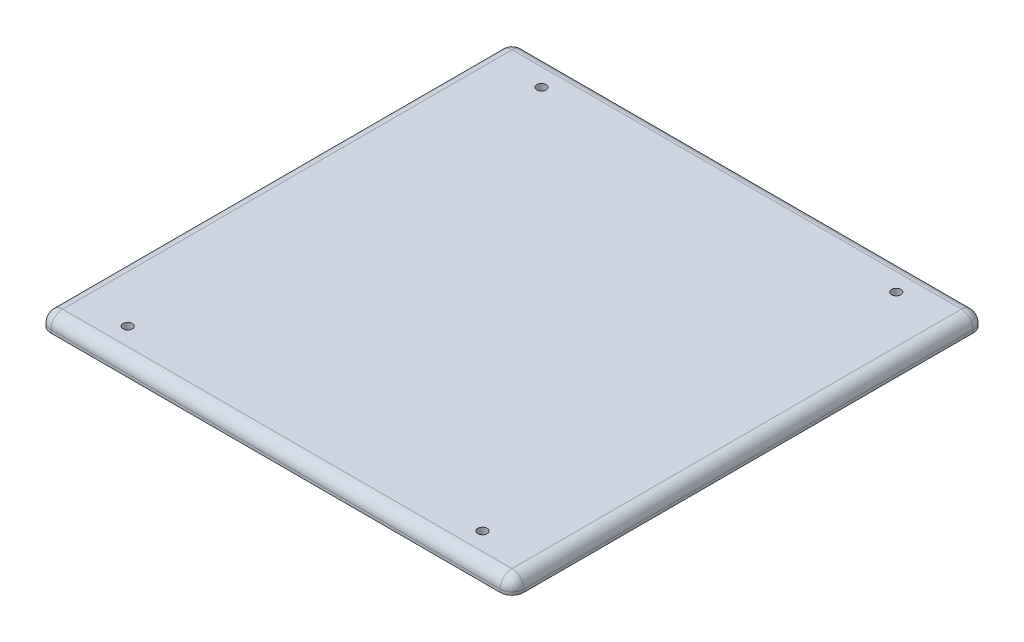
ISO-10303-21;
HEADER;
FILE_DESCRIPTION(('STEP AP214'),'2;1');
FILE_NAME('part.step','',(''),(''),'','','');
FILE_SCHEMA(('AUTOMOTIVE_DESIGN { 1 0 10303 214 1 1 1 1 }'));
ENDSEC;
DATA;
#1=APPLICATION_CONTEXT('core data for automotive mechanical design processes');
#2=APPLICATION_PROTOCOL_DEFINITION('international standard','automotive_design',2000,#1);
#3=PRODUCT_CONTEXT('',#1,'mechanical');
#4=PRODUCT('Part','Part','',(#3));
#5=PRODUCT_RELATED_PRODUCT_CATEGORY('part','',(#4));
#6=PRODUCT_DEFINITION_FORMATION('','',#4);
#7=PRODUCT_DEFINITION_CONTEXT('part definition',#1,'design');
#8=PRODUCT_DEFINITION('design','',#6,#7);
#9=PRODUCT_DEFINITION_SHAPE('','',#8);
#10=(LENGTH_UNIT() NAMED_UNIT(*) SI_UNIT(.MILLI.,.METRE.));
#11=(NAMED_UNIT(*) PLANE_ANGLE_UNIT() SI_UNIT($,.RADIAN.));
#12=(NAMED_UNIT(*) SI_UNIT($,.STERADIAN.) SOLID_ANGLE_UNIT());
#13=UNCERTAINTY_MEASURE_WITH_UNIT(LENGTH_MEASURE(1.E-05),#10,'distance_accuracy_value','');
#14=(GEOMETRIC_REPRESENTATION_CONTEXT(3) GLOBAL_UNCERTAINTY_ASSIGNED_CONTEXT((#13)) GLOBAL_UNIT_ASSIGNED_CONTEXT((#10,
#11,#12)) REPRESENTATION_CONTEXT('',''));
#15=CARTESIAN_POINT('',(0.,0.,0.));
#16=DIRECTION('',(0.,0.,1.));
#17=DIRECTION('',(1.,0.,0.));
#18=AXIS2_PLACEMENT_3D('',#15,#16,#17);
#19=CARTESIAN_POINT('',(-50.8,3.175,50.8));
#20=DIRECTION('',(1.,0.,0.));
#21=DIRECTION('',(0.,0.,-1.));
#22=AXIS2_PLACEMENT_3D('',#19,#20,#21);
#23=PLANE('',#22);
#24=DIRECTION('',(0.,0.,1.));
#25=VECTOR('',#24,1.);
#26=CARTESIAN_POINT('',(-50.8,0.,50.8));
#27=LINE('',#26,#25);
#28=CARTESIAN_POINT('',(-50.8,0.,-48.26));
#29=VERTEX_POINT('',#28);
#30=CARTESIAN_POINT('',(-50.8,0.,48.26));
#31=VERTEX_POINT('',#30);
#32=EDGE_CURVE('E158',#29,#31,#27,.T.);
#33=ORIENTED_EDGE('',*,*,#32,.T.);
#34=DIRECTION('',(0.,-1.,0.));
#35=VECTOR('',#34,1.);
#36=CARTESIAN_POINT('',(-50.8,3.175,48.26));
#37=LINE('',#36,#35);
#38=CARTESIAN_POINT('',(-50.8,0.635,48.26));
#39=VERTEX_POINT('',#38);
#40=EDGE_CURVE('E133',#31,#39,#37,.F.);
#41=ORIENTED_EDGE('',*,*,#40,.T.);
#42=DIRECTION('',(0.,0.,1.));
#43=VECTOR('',#42,1.);
#44=CARTESIAN_POINT('',(-50.8,0.635,-50.8));
#45=LINE('',#44,#43);
#46=CARTESIAN_POINT('',(-50.8,0.635,-48.26));
#47=VERTEX_POINT('',#46);
#48=EDGE_CURVE('E139',#39,#47,#45,.F.);
#49=ORIENTED_EDGE('',*,*,#48,.T.);
#50=DIRECTION('',(0.,-1.,0.));
#51=VECTOR('',#50,1.);
#52=CARTESIAN_POINT('',(-50.8,3.175,-48.26));
#53=LINE('',#52,#51);
#54=EDGE_CURVE('E217',#47,#29,#53,.T.);
#55=ORIENTED_EDGE('',*,*,#54,.T.);
#56=EDGE_LOOP('',(#33,#41,#49,#55));
#57=FACE_BOUND('',#56,.T.);
#58=ADVANCED_FACE('F47',(#57),#23,.F.);
#59=CARTESIAN_POINT('',(50.8,3.175,50.8));
#60=DIRECTION('',(0.,0.,-1.));
#61=DIRECTION('',(-1.,0.,0.));
#62=AXIS2_PLACEMENT_3D('',#59,#60,#61);
#63=PLANE('',#62);
#64=DIRECTION('',(1.,0.,0.));
#65=VECTOR('',#64,1.);
#66=CARTESIAN_POINT('',(-50.8,0.635,50.8));
#67=LINE('',#66,#65);
#68=CARTESIAN_POINT('',(48.26,0.635,50.8));
#69=VERTEX_POINT('',#68);
#70=CARTESIAN_POINT('',(-48.26,0.635,50.8));
#71=VERTEX_POINT('',#70);
#72=EDGE_CURVE('E147',#69,#71,#67,.F.);
#73=ORIENTED_EDGE('',*,*,#72,.T.);
#74=DIRECTION('',(0.,-1.,0.));
#75=VECTOR('',#74,1.);
#76=CARTESIAN_POINT('',(-48.26,3.175,50.8));
#77=LINE('',#76,#75);
#78=CARTESIAN_POINT('',(-48.26,0.,50.8));
#79=VERTEX_POINT('',#78);
#80=EDGE_CURVE('E132',#71,#79,#77,.T.);
#81=ORIENTED_EDGE('',*,*,#80,.T.);
#82=DIRECTION('',(1.,0.,0.));
#83=VECTOR('',#82,1.);
#84=CARTESIAN_POINT('',(50.8,0.,50.8));
#85=LINE('',#84,#83);
#86=CARTESIAN_POINT('',(48.26,0.,50.8));
#87=VERTEX_POINT('',#86);
#88=EDGE_CURVE('E145',#79,#87,#85,.T.);
#89=ORIENTED_EDGE('',*,*,#88,.T.);
#90=DIRECTION('',(0.,-1.,0.));
#91=VECTOR('',#90,1.);
#92=CARTESIAN_POINT('',(48.26,3.175,50.8));
#93=LINE('',#92,#91);
#94=EDGE_CURVE('E151',#87,#69,#93,.F.);
#95=ORIENTED_EDGE('',*,*,#94,.T.);
#96=EDGE_LOOP('',(#73,#81,#89,#95));
#97=FACE_BOUND('',#96,.T.);
#98=ADVANCED_FACE('F144',(#97),#63,.F.);
#99=CARTESIAN_POINT('',(50.8,3.175,50.8));
#100=DIRECTION('',(-1.,0.,0.));
#101=DIRECTION('',(0.,0.,1.));
#102=AXIS2_PLACEMENT_3D('',#99,#100,#101);
#103=PLANE('',#102);
#104=DIRECTION('',(0.,0.,-1.));
#105=VECTOR('',#104,1.);
#106=CARTESIAN_POINT('',(50.8,0.,50.8));
#107=LINE('',#106,#105);
#108=CARTESIAN_POINT('',(50.8,0.,48.26));
#109=VERTEX_POINT('',#108);
#110=CARTESIAN_POINT('',(50.8,0.,-48.26));
#111=VERTEX_POINT('',#110);
#112=EDGE_CURVE('E157',#109,#111,#107,.T.);
#113=ORIENTED_EDGE('',*,*,#112,.T.);
#114=DIRECTION('',(0.,-1.,0.));
#115=VECTOR('',#114,1.);
#116=CARTESIAN_POINT('',(50.8,3.175,-48.26));
#117=LINE('',#116,#115);
#118=CARTESIAN_POINT('',(50.8,0.635,-48.26));
#119=VERTEX_POINT('',#118);
#120=EDGE_CURVE('E237',#111,#119,#117,.F.);
#121=ORIENTED_EDGE('',*,*,#120,.T.);
#122=DIRECTION('',(0.,0.,-1.));
#123=VECTOR('',#122,1.);
#124=CARTESIAN_POINT('',(50.8,0.635,50.8));
#125=LINE('',#124,#123);
#126=CARTESIAN_POINT('',(50.8,0.635,48.26));
#127=VERTEX_POINT('',#126);
#128=EDGE_CURVE('E231',#119,#127,#125,.F.);
#129=ORIENTED_EDGE('',*,*,#128,.T.);
#130=DIRECTION('',(0.,-1.,0.));
#131=VECTOR('',#130,1.);
#132=CARTESIAN_POINT('',(50.8,3.175,48.26));
#133=LINE('',#132,#131);
#134=EDGE_CURVE('E234',#127,#109,#133,.T.);
#135=ORIENTED_EDGE('',*,*,#134,.T.);
#136=EDGE_LOOP('',(#113,#121,#129,#135));
#137=FACE_BOUND('',#136,.T.);
#138=ADVANCED_FACE('F328',(#137),#103,.F.);
#139=CARTESIAN_POINT('',(50.8,3.175,-50.8));
#140=DIRECTION('',(0.,0.,1.));
#141=DIRECTION('',(1.,0.,0.));
#142=AXIS2_PLACEMENT_3D('',#139,#140,#141);
#143=PLANE('',#142);
#144=DIRECTION('',(-1.,0.,0.));
#145=VECTOR('',#144,1.);
#146=CARTESIAN_POINT('',(50.8,0.,-50.8));
#147=LINE('',#146,#145);
#148=CARTESIAN_POINT('',(48.26,0.,-50.8));
#149=VERTEX_POINT('',#148);
#150=CARTESIAN_POINT('',(-48.26,0.,-50.8));
#151=VERTEX_POINT('',#150);
#152=EDGE_CURVE('E163',#149,#151,#147,.T.);
#153=ORIENTED_EDGE('',*,*,#152,.T.);
#154=DIRECTION('',(0.,-1.,0.));
#155=VECTOR('',#154,1.);
#156=CARTESIAN_POINT('',(-48.26,3.175,-50.8));
#157=LINE('',#156,#155);
#158=CARTESIAN_POINT('',(-48.26,0.635,-50.8));
#159=VERTEX_POINT('',#158);
#160=EDGE_CURVE('E228',#151,#159,#157,.F.);
#161=ORIENTED_EDGE('',*,*,#160,.T.);
#162=DIRECTION('',(-1.,0.,0.));
#163=VECTOR('',#162,1.);
#164=CARTESIAN_POINT('',(50.8,0.635,-50.8));
#165=LINE('',#164,#163);
#166=CARTESIAN_POINT('',(48.26,0.635,-50.8));
#167=VERTEX_POINT('',#166);
#168=EDGE_CURVE('E222',#159,#167,#165,.F.);
#169=ORIENTED_EDGE('',*,*,#168,.T.);
#170=DIRECTION('',(0.,-1.,0.));
#171=VECTOR('',#170,1.);
#172=CARTESIAN_POINT('',(48.26,3.175,-50.8));
#173=LINE('',#172,#171);
#174=EDGE_CURVE('E225',#167,#149,#173,.T.);
#175=ORIENTED_EDGE('',*,*,#174,.T.);
#176=EDGE_LOOP('',(#153,#161,#169,#175));
#177=FACE_BOUND('',#176,.T.);
#178=ADVANCED_FACE('F319',(#177),#143,.F.);
#179=CARTESIAN_POINT('',(0.,3.175,0.));
#180=DIRECTION('',(0.,1.,0.));
#181=DIRECTION('',(0.,0.,1.));
#182=AXIS2_PLACEMENT_3D('',#179,#180,#181);
#183=PLANE('',#182);
#184=DIRECTION('',(0.,0.,1.));
#185=VECTOR('',#184,1.);
#186=CARTESIAN_POINT('',(-48.26,3.175,50.8));
#187=LINE('',#186,#185);
#188=CARTESIAN_POINT('',(-48.26,3.175,-48.26));
#189=VERTEX_POINT('',#188);
#190=CARTESIAN_POINT('',(-48.26,3.175,48.26));
#191=VERTEX_POINT('',#190);
#192=EDGE_CURVE('E240',#189,#191,#187,.T.);
#193=ORIENTED_EDGE('',*,*,#192,.T.);
#194=DIRECTION('',(1.,0.,0.));
#195=VECTOR('',#194,1.);
#196=CARTESIAN_POINT('',(50.8,3.175,48.26));
#197=LINE('',#196,#195);
#198=CARTESIAN_POINT('',(48.26,3.175,48.26));
#199=VERTEX_POINT('',#198);
#200=EDGE_CURVE('E11',#191,#199,#197,.T.);
#201=ORIENTED_EDGE('',*,*,#200,.T.);
#202=DIRECTION('',(0.,0.,-1.));
#203=VECTOR('',#202,1.);
#204=CARTESIAN_POINT('',(48.26,3.175,-50.8));
#205=LINE('',#204,#203);
#206=CARTESIAN_POINT('',(48.26,3.175,-48.26));
#207=VERTEX_POINT('',#206);
#208=EDGE_CURVE('E57',#199,#207,#205,.T.);
#209=ORIENTED_EDGE('',*,*,#208,.T.);
#210=DIRECTION('',(-1.,0.,0.));
#211=VECTOR('',#210,1.);
#212=CARTESIAN_POINT('',(-50.8,3.175,-48.26));
#213=LINE('',#212,#211);
#214=EDGE_CURVE('E243',#207,#189,#213,.T.);
#215=ORIENTED_EDGE('',*,*,#214,.T.);
#216=EDGE_LOOP('',(#193,#201,#209,#215));
#217=FACE_BOUND('',#216,.T.);
#218=CARTESIAN_POINT('',(-38.1,3.175,-44.45));
#219=DIRECTION('',(0.,1.,0.));
#220=DIRECTION('',(0.,0.,-1.));
#221=AXIS2_PLACEMENT_3D('',#218,#219,#220);
#222=CIRCLE('',#221,0.999490000000001);
#223=CARTESIAN_POINT('',(-38.1,3.175,-45.44949));
#224=VERTEX_POINT('',#223);
#225=EDGE_CURVE('E291',#224,#224,#222,.T.);
#226=ORIENTED_EDGE('',*,*,#225,.F.);
#227=EDGE_LOOP('',(#226));
#228=FACE_BOUND('',#227,.T.);
#229=CARTESIAN_POINT('',(38.1,3.175,-44.45));
#230=DIRECTION('',(0.,1.,0.));
#231=DIRECTION('',(0.,0.,1.));
#232=AXIS2_PLACEMENT_3D('',#229,#230,#231);
#233=CIRCLE('',#232,0.999490000000001);
#234=CARTESIAN_POINT('',(38.1,3.175,-43.45051));
#235=VERTEX_POINT('',#234);
#236=EDGE_CURVE('E297',#235,#235,#233,.T.);
#237=ORIENTED_EDGE('',*,*,#236,.F.);
#238=EDGE_LOOP('',(#237));
#239=FACE_BOUND('',#238,.T.);
#240=CARTESIAN_POINT('',(38.1,3.175,44.45));
#241=DIRECTION('',(0.,1.,0.));
#242=DIRECTION('',(0.,0.,-1.));
#243=AXIS2_PLACEMENT_3D('',#240,#241,#242);
#244=CIRCLE('',#243,0.999490000000001);
#245=CARTESIAN_POINT('',(38.1,3.175,43.45051));
#246=VERTEX_POINT('',#245);
#247=EDGE_CURVE('E303',#246,#246,#244,.T.);
#248=ORIENTED_EDGE('',*,*,#247,.F.);
#249=EDGE_LOOP('',(#248));
#250=FACE_BOUND('',#249,.T.);
#251=CARTESIAN_POINT('',(-38.1,3.175,44.45));
#252=DIRECTION('',(0.,1.,0.));
#253=DIRECTION('',(0.,0.,1.));
#254=AXIS2_PLACEMENT_3D('',#251,#252,#253);
#255=CIRCLE('',#254,0.999490000000001);
#256=CARTESIAN_POINT('',(-38.1,3.175,45.44949));
#257=VERTEX_POINT('',#256);
#258=EDGE_CURVE('E165',#257,#257,#255,.T.);
#259=ORIENTED_EDGE('',*,*,#258,.F.);
#260=EDGE_LOOP('',(#259));
#261=FACE_BOUND('',#260,.T.);
#262=ADVANCED_FACE('F316',(#217,#228,#239,#250,#261),#183,.T.);
#263=CARTESIAN_POINT('',(0.,0.,0.));
#264=DIRECTION('',(0.,1.,0.));
#265=DIRECTION('',(0.,0.,1.));
#266=AXIS2_PLACEMENT_3D('',#263,#264,#265);
#267=PLANE('',#266);
#268=CARTESIAN_POINT('',(-38.1,0.,44.45));
#269=DIRECTION('',(0.,1.,0.));
#270=DIRECTION('',(0.,0.,1.));
#271=AXIS2_PLACEMENT_3D('',#268,#269,#270);
#272=CIRCLE('',#271,2.26949000000001);
#273=CARTESIAN_POINT('',(-38.1,0.,46.71949));
#274=VERTEX_POINT('',#273);
#275=EDGE_CURVE('E184',#274,#274,#272,.T.);
#276=ORIENTED_EDGE('',*,*,#275,.T.);
#277=EDGE_LOOP('',(#276));
#278=FACE_BOUND('',#277,.T.);
#279=CARTESIAN_POINT('',(38.1,0.,44.45));
#280=DIRECTION('',(0.,1.,0.));
#281=DIRECTION('',(0.,0.,1.));
#282=AXIS2_PLACEMENT_3D('',#279,#280,#281);
#283=CIRCLE('',#282,2.26948999999997);
#284=CARTESIAN_POINT('',(38.1,0.,46.7194899999999));
#285=VERTEX_POINT('',#284);
#286=EDGE_CURVE('E180',#285,#285,#283,.T.);
#287=ORIENTED_EDGE('',*,*,#286,.T.);
#288=EDGE_LOOP('',(#287));
#289=FACE_BOUND('',#288,.T.);
#290=CARTESIAN_POINT('',(-38.1,0.,-44.45));
#291=DIRECTION('',(0.,1.,0.));
#292=DIRECTION('',(0.,0.,1.));
#293=AXIS2_PLACEMENT_3D('',#290,#291,#292);
#294=CIRCLE('',#293,2.26949000000001);
#295=CARTESIAN_POINT('',(-38.1,0.,-42.18051));
#296=VERTEX_POINT('',#295);
#297=EDGE_CURVE('E176',#296,#296,#294,.T.);
#298=ORIENTED_EDGE('',*,*,#297,.T.);
#299=EDGE_LOOP('',(#298));
#300=FACE_BOUND('',#299,.T.);
#301=CARTESIAN_POINT('',(38.1,0.,-44.45));
#302=DIRECTION('',(0.,1.,0.));
#303=DIRECTION('',(0.,0.,1.));
#304=AXIS2_PLACEMENT_3D('',#301,#302,#303);
#305=CIRCLE('',#304,2.26948999999997);
#306=CARTESIAN_POINT('',(38.1,0.,-42.18051));
#307=VERTEX_POINT('',#306);
#308=EDGE_CURVE('E172',#307,#307,#305,.T.);
#309=ORIENTED_EDGE('',*,*,#308,.T.);
#310=EDGE_LOOP('',(#309));
#311=FACE_BOUND('',#310,.T.);
#312=ORIENTED_EDGE('',*,*,#88,.F.);
#313=CARTESIAN_POINT('',(-48.26,0.,48.26));
#314=DIRECTION('',(0.,1.,0.));
#315=DIRECTION('',(0.,0.,1.));
#316=AXIS2_PLACEMENT_3D('',#313,#314,#315);
#317=CIRCLE('',#316,2.54);
#318=EDGE_CURVE('E128',#79,#31,#317,.F.);
#319=ORIENTED_EDGE('',*,*,#318,.T.);
#320=ORIENTED_EDGE('',*,*,#32,.F.);
#321=CARTESIAN_POINT('',(-48.26,0.,-48.26));
#322=DIRECTION('',(0.,1.,0.));
#323=DIRECTION('',(0.,0.,1.));
#324=AXIS2_PLACEMENT_3D('',#321,#322,#323);
#325=CIRCLE('',#324,2.54);
#326=EDGE_CURVE('E140',#29,#151,#325,.F.);
#327=ORIENTED_EDGE('',*,*,#326,.T.);
#328=ORIENTED_EDGE('',*,*,#152,.F.);
#329=CARTESIAN_POINT('',(48.26,0.,-48.26));
#330=DIRECTION('',(0.,1.,0.));
#331=DIRECTION('',(0.,0.,1.));
#332=AXIS2_PLACEMENT_3D('',#329,#330,#331);
#333=CIRCLE('',#332,2.54);
#334=EDGE_CURVE('E210',#149,#111,#333,.F.);
#335=ORIENTED_EDGE('',*,*,#334,.T.);
#336=ORIENTED_EDGE('',*,*,#112,.F.);
#337=CARTESIAN_POINT('',(48.26,0.,48.26));
#338=DIRECTION('',(0.,1.,0.));
#339=DIRECTION('',(0.,0.,1.));
#340=AXIS2_PLACEMENT_3D('',#337,#338,#339);
#341=CIRCLE('',#340,2.54);
#342=EDGE_CURVE('E150',#109,#87,#341,.F.);
#343=ORIENTED_EDGE('',*,*,#342,.T.);
#344=EDGE_LOOP('',(#312,#319,#320,#327,#328,#335,#336,#343));
#345=FACE_BOUND('',#344,.T.);
#346=ADVANCED_FACE('F153',(#278,#289,#300,#311,#345),#267,.F.);
#347=CARTESIAN_POINT('',(-38.1,0.,44.45));
#348=DIRECTION('',(0.,1.,0.));
#349=DIRECTION('',(0.,0.,1.));
#350=AXIS2_PLACEMENT_3D('',#347,#348,#349);
#351=CYLINDRICAL_SURFACE('',#350,0.999490000000001);
#352=CARTESIAN_POINT('',(-38.1,1.27000000000002,44.45));
#353=DIRECTION('',(0.,1.,0.));
#354=DIRECTION('',(0.,0.,1.));
#355=AXIS2_PLACEMENT_3D('',#352,#353,#354);
#356=CIRCLE('',#355,0.999490000000001);
#357=CARTESIAN_POINT('',(-38.1,1.27000000000002,45.44949));
#358=VERTEX_POINT('',#357);
#359=EDGE_CURVE('E188',#358,#358,#356,.F.);
#360=ORIENTED_EDGE('',*,*,#359,.T.);
#361=EDGE_LOOP('',(#360));
#362=FACE_BOUND('',#361,.T.);
#363=ORIENTED_EDGE('',*,*,#258,.T.);
#364=EDGE_LOOP('',(#363));
#365=FACE_BOUND('',#364,.T.);
#366=ADVANCED_FACE('F325',(#362,#365),#351,.F.);
#367=CARTESIAN_POINT('',(38.1,0.,44.45));
#368=DIRECTION('',(0.,1.,0.));
#369=DIRECTION('',(0.,0.,1.));
#370=AXIS2_PLACEMENT_3D('',#367,#368,#369);
#371=CYLINDRICAL_SURFACE('',#370,0.999490000000001);
#372=CARTESIAN_POINT('',(38.1,1.26999999999998,44.45));
#373=DIRECTION('',(0.,1.,0.));
#374=DIRECTION('',(0.,0.,1.));
#375=AXIS2_PLACEMENT_3D('',#372,#373,#374);
#376=CIRCLE('',#375,0.999490000000001);
#377=CARTESIAN_POINT('',(38.1,1.26999999999998,45.44949));
#378=VERTEX_POINT('',#377);
#379=EDGE_CURVE('E192',#378,#378,#376,.F.);
#380=ORIENTED_EDGE('',*,*,#379,.T.);
#381=EDGE_LOOP('',(#380));
#382=FACE_BOUND('',#381,.T.);
#383=ORIENTED_EDGE('',*,*,#247,.T.);
#384=EDGE_LOOP('',(#383));
#385=FACE_BOUND('',#384,.T.);
#386=ADVANCED_FACE('F314',(#382,#385),#371,.F.);
#387=CARTESIAN_POINT('',(38.1,0.,-44.45));
#388=DIRECTION('',(0.,1.,0.));
#389=DIRECTION('',(0.,0.,1.));
#390=AXIS2_PLACEMENT_3D('',#387,#388,#389);
#391=CYLINDRICAL_SURFACE('',#390,0.999490000000001);
#392=CARTESIAN_POINT('',(38.1,1.26999999999998,-44.45));
#393=DIRECTION('',(0.,1.,0.));
#394=DIRECTION('',(0.,0.,1.));
#395=AXIS2_PLACEMENT_3D('',#392,#393,#394);
#396=CIRCLE('',#395,0.999490000000001);
#397=CARTESIAN_POINT('',(38.1,1.26999999999998,-43.45051));
#398=VERTEX_POINT('',#397);
#399=EDGE_CURVE('E200',#398,#398,#396,.F.);
#400=ORIENTED_EDGE('',*,*,#399,.T.);
#401=EDGE_LOOP('',(#400));
#402=FACE_BOUND('',#401,.T.);
#403=ORIENTED_EDGE('',*,*,#236,.T.);
#404=EDGE_LOOP('',(#403));
#405=FACE_BOUND('',#404,.T.);
#406=ADVANCED_FACE('F469',(#402,#405),#391,.F.);
#407=CARTESIAN_POINT('',(-38.1,0.,-44.45));
#408=DIRECTION('',(0.,1.,0.));
#409=DIRECTION('',(0.,0.,1.));
#410=AXIS2_PLACEMENT_3D('',#407,#408,#409);
#411=CYLINDRICAL_SURFACE('',#410,0.999490000000001);
#412=CARTESIAN_POINT('',(-38.1,1.27000000000002,-44.45));
#413=DIRECTION('',(0.,1.,0.));
#414=DIRECTION('',(0.,0.,1.));
#415=AXIS2_PLACEMENT_3D('',#412,#413,#414);
#416=CIRCLE('',#415,0.999490000000001);
#417=CARTESIAN_POINT('',(-38.1,1.27000000000002,-43.45051));
#418=VERTEX_POINT('',#417);
#419=EDGE_CURVE('E196',#418,#418,#416,.F.);
#420=ORIENTED_EDGE('',*,*,#419,.T.);
#421=EDGE_LOOP('',(#420));
#422=FACE_BOUND('',#421,.T.);
#423=ORIENTED_EDGE('',*,*,#225,.T.);
#424=EDGE_LOOP('',(#423));
#425=FACE_BOUND('',#424,.T.);
#426=ADVANCED_FACE('F351',(#422,#425),#411,.F.);
#427=CARTESIAN_POINT('',(-38.1,0.,44.45));
#428=DIRECTION('',(0.,-1.,0.));
#429=DIRECTION('',(0.,0.,-1.));
#430=AXIS2_PLACEMENT_3D('',#427,#428,#429);
#431=CONICAL_SURFACE('',#430,2.26949000000001,0.785398163397446);
#432=ORIENTED_EDGE('',*,*,#359,.F.);
#433=EDGE_LOOP('',(#432));
#434=FACE_BOUND('',#433,.T.);
#435=ORIENTED_EDGE('',*,*,#275,.F.);
#436=EDGE_LOOP('',(#435));
#437=FACE_BOUND('',#436,.T.);
#438=ADVANCED_FACE('F344',(#434,#437),#431,.F.);
#439=CARTESIAN_POINT('',(38.1,0.,44.45));
#440=DIRECTION('',(0.,-1.,0.));
#441=DIRECTION('',(0.,0.,-1.));
#442=AXIS2_PLACEMENT_3D('',#439,#440,#441);
#443=CONICAL_SURFACE('',#442,2.26948999999997,0.785398163397446);
#444=ORIENTED_EDGE('',*,*,#379,.F.);
#445=EDGE_LOOP('',(#444));
#446=FACE_BOUND('',#445,.T.);
#447=ORIENTED_EDGE('',*,*,#286,.F.);
#448=EDGE_LOOP('',(#447));
#449=FACE_BOUND('',#448,.T.);
#450=ADVANCED_FACE('F350',(#446,#449),#443,.F.);
#451=CARTESIAN_POINT('',(-38.1,0.,-44.45));
#452=DIRECTION('',(0.,-1.,0.));
#453=DIRECTION('',(0.,0.,-1.));
#454=AXIS2_PLACEMENT_3D('',#451,#452,#453);
#455=CONICAL_SURFACE('',#454,2.26949000000001,0.785398163397446);
#456=ORIENTED_EDGE('',*,*,#419,.F.);
#457=EDGE_LOOP('',(#456));
#458=FACE_BOUND('',#457,.T.);
#459=ORIENTED_EDGE('',*,*,#297,.F.);
#460=EDGE_LOOP('',(#459));
#461=FACE_BOUND('',#460,.T.);
#462=ADVANCED_FACE('F358',(#458,#461),#455,.F.);
#463=CARTESIAN_POINT('',(38.1,0.,-44.45));
#464=DIRECTION('',(0.,-1.,0.));
#465=DIRECTION('',(0.,0.,-1.));
#466=AXIS2_PLACEMENT_3D('',#463,#464,#465);
#467=CONICAL_SURFACE('',#466,2.26948999999997,0.785398163397446);
#468=ORIENTED_EDGE('',*,*,#399,.F.);
#469=EDGE_LOOP('',(#468));
#470=FACE_BOUND('',#469,.T.);
#471=ORIENTED_EDGE('',*,*,#308,.F.);
#472=EDGE_LOOP('',(#471));
#473=FACE_BOUND('',#472,.T.);
#474=ADVANCED_FACE('F365',(#470,#473),#467,.F.);
#475=CARTESIAN_POINT('',(48.26,3.175,-48.26));
#476=DIRECTION('',(0.,-1.,0.));
#477=DIRECTION('',(0.,0.,-1.));
#478=AXIS2_PLACEMENT_3D('',#475,#476,#477);
#479=CYLINDRICAL_SURFACE('',#478,2.54);
#480=CARTESIAN_POINT('',(48.26,0.635,-48.26));
#481=DIRECTION('',(0.,1.,0.));
#482=DIRECTION('',(0.,0.,1.));
#483=AXIS2_PLACEMENT_3D('',#480,#481,#482);
#484=CIRCLE('',#483,2.54);
#485=EDGE_CURVE('E51',#119,#167,#484,.T.);
#486=ORIENTED_EDGE('',*,*,#485,.F.);
#487=ORIENTED_EDGE('',*,*,#120,.F.);
#488=ORIENTED_EDGE('',*,*,#334,.F.);
#489=ORIENTED_EDGE('',*,*,#174,.F.);
#490=EDGE_LOOP('',(#486,#487,#488,#489));
#491=FACE_BOUND('',#490,.T.);
#492=ADVANCED_FACE('F49',(#491),#479,.T.);
#493=CARTESIAN_POINT('',(48.26,0.635,-48.26));
#494=DIRECTION('',(0.,0.,-1.));
#495=DIRECTION('',(-1.,0.,0.));
#496=AXIS2_PLACEMENT_3D('',#493,#494,#495);
#497=SPHERICAL_SURFACE('',#496,2.54);
#498=CARTESIAN_POINT('',(48.26,0.635,-48.26));
#499=DIRECTION('',(0.,0.,-1.));
#500=DIRECTION('',(-1.,0.,0.));
#501=AXIS2_PLACEMENT_3D('',#498,#499,#500);
#502=CIRCLE('',#501,2.54);
#503=EDGE_CURVE('E280',#119,#207,#502,.F.);
#504=ORIENTED_EDGE('',*,*,#503,.F.);
#505=ORIENTED_EDGE('',*,*,#485,.T.);
#506=CARTESIAN_POINT('',(48.26,0.635,-48.26));
#507=DIRECTION('',(1.,0.,0.));
#508=DIRECTION('',(0.,0.,-1.));
#509=AXIS2_PLACEMENT_3D('',#506,#507,#508);
#510=CIRCLE('',#509,2.54);
#511=EDGE_CURVE('E282',#207,#167,#510,.F.);
#512=ORIENTED_EDGE('',*,*,#511,.F.);
#513=EDGE_LOOP('',(#504,#505,#512));
#514=FACE_BOUND('',#513,.T.);
#515=ADVANCED_FACE('F405',(#514),#497,.T.);
#516=CARTESIAN_POINT('',(-48.26,3.175,-48.26));
#517=DIRECTION('',(0.,-1.,0.));
#518=DIRECTION('',(0.,0.,-1.));
#519=AXIS2_PLACEMENT_3D('',#516,#517,#518);
#520=CYLINDRICAL_SURFACE('',#519,2.54);
#521=ORIENTED_EDGE('',*,*,#326,.F.);
#522=ORIENTED_EDGE('',*,*,#54,.F.);
#523=CARTESIAN_POINT('',(-48.26,0.635,-48.26));
#524=DIRECTION('',(0.,1.,0.));
#525=DIRECTION('',(0.,0.,1.));
#526=AXIS2_PLACEMENT_3D('',#523,#524,#525);
#527=CIRCLE('',#526,2.54);
#528=EDGE_CURVE('E276',#159,#47,#527,.T.);
#529=ORIENTED_EDGE('',*,*,#528,.F.);
#530=ORIENTED_EDGE('',*,*,#160,.F.);
#531=EDGE_LOOP('',(#521,#522,#529,#530));
#532=FACE_BOUND('',#531,.T.);
#533=ADVANCED_FACE('F403',(#532),#520,.T.);
#534=CARTESIAN_POINT('',(0.,0.635,-48.26));
#535=DIRECTION('',(1.,0.,0.));
#536=DIRECTION('',(0.,0.,-1.));
#537=AXIS2_PLACEMENT_3D('',#534,#535,#536);
#538=CYLINDRICAL_SURFACE('',#537,2.54);
#539=ORIENTED_EDGE('',*,*,#511,.T.);
#540=ORIENTED_EDGE('',*,*,#168,.F.);
#541=CARTESIAN_POINT('',(-48.26,0.635,-48.26));
#542=DIRECTION('',(-1.,0.,0.));
#543=DIRECTION('',(0.,0.,1.));
#544=AXIS2_PLACEMENT_3D('',#541,#542,#543);
#545=CIRCLE('',#544,2.54);
#546=EDGE_CURVE('E272',#189,#159,#545,.T.);
#547=ORIENTED_EDGE('',*,*,#546,.F.);
#548=ORIENTED_EDGE('',*,*,#214,.F.);
#549=EDGE_LOOP('',(#539,#540,#547,#548));
#550=FACE_BOUND('',#549,.T.);
#551=ADVANCED_FACE('F399',(#550),#538,.T.);
#552=CARTESIAN_POINT('',(48.26,0.635,0.));
#553=DIRECTION('',(0.,0.,1.));
#554=DIRECTION('',(1.,0.,0.));
#555=AXIS2_PLACEMENT_3D('',#552,#553,#554);
#556=CYLINDRICAL_SURFACE('',#555,2.54);
#557=ORIENTED_EDGE('',*,*,#503,.T.);
#558=ORIENTED_EDGE('',*,*,#208,.F.);
#559=CARTESIAN_POINT('',(48.26,0.635,48.26));
#560=DIRECTION('',(0.,0.,1.));
#561=DIRECTION('',(1.,0.,0.));
#562=AXIS2_PLACEMENT_3D('',#559,#560,#561);
#563=CIRCLE('',#562,2.54);
#564=EDGE_CURVE('E269',#127,#199,#563,.T.);
#565=ORIENTED_EDGE('',*,*,#564,.F.);
#566=ORIENTED_EDGE('',*,*,#128,.F.);
#567=EDGE_LOOP('',(#557,#558,#565,#566));
#568=FACE_BOUND('',#567,.T.);
#569=ADVANCED_FACE('F395',(#568),#556,.T.);
#570=CARTESIAN_POINT('',(48.26,3.175,48.26));
#571=DIRECTION('',(0.,-1.,0.));
#572=DIRECTION('',(0.,0.,-1.));
#573=AXIS2_PLACEMENT_3D('',#570,#571,#572);
#574=CYLINDRICAL_SURFACE('',#573,2.54);
#575=ORIENTED_EDGE('',*,*,#342,.F.);
#576=ORIENTED_EDGE('',*,*,#134,.F.);
#577=CARTESIAN_POINT('',(48.26,0.635,48.26));
#578=DIRECTION('',(0.,1.,0.));
#579=DIRECTION('',(0.,0.,1.));
#580=AXIS2_PLACEMENT_3D('',#577,#578,#579);
#581=CIRCLE('',#580,2.54);
#582=EDGE_CURVE('E265',#69,#127,#581,.T.);
#583=ORIENTED_EDGE('',*,*,#582,.F.);
#584=ORIENTED_EDGE('',*,*,#94,.F.);
#585=EDGE_LOOP('',(#575,#576,#583,#584));
#586=FACE_BOUND('',#585,.T.);
#587=ADVANCED_FACE('F391',(#586),#574,.T.);
#588=CARTESIAN_POINT('',(-48.26,0.635,-48.26));
#589=DIRECTION('',(0.,0.,-1.));
#590=DIRECTION('',(-1.,0.,0.));
#591=AXIS2_PLACEMENT_3D('',#588,#589,#590);
#592=SPHERICAL_SURFACE('',#591,2.54);
#593=ORIENTED_EDGE('',*,*,#546,.T.);
#594=ORIENTED_EDGE('',*,*,#528,.T.);
#595=CARTESIAN_POINT('',(-48.26,0.635,-48.26));
#596=DIRECTION('',(0.,0.,-1.));
#597=DIRECTION('',(-1.,0.,0.));
#598=AXIS2_PLACEMENT_3D('',#595,#596,#597);
#599=CIRCLE('',#598,2.54);
#600=EDGE_CURVE('E261',#189,#47,#599,.F.);
#601=ORIENTED_EDGE('',*,*,#600,.F.);
#602=EDGE_LOOP('',(#593,#594,#601));
#603=FACE_BOUND('',#602,.T.);
#604=ADVANCED_FACE('F387',(#603),#592,.T.);
#605=CARTESIAN_POINT('',(48.26,0.635,48.26));
#606=DIRECTION('',(1.,0.,0.));
#607=DIRECTION('',(0.,0.,-1.));
#608=AXIS2_PLACEMENT_3D('',#605,#606,#607);
#609=SPHERICAL_SURFACE('',#608,2.54);
#610=ORIENTED_EDGE('',*,*,#582,.T.);
#611=ORIENTED_EDGE('',*,*,#564,.T.);
#612=CARTESIAN_POINT('',(48.26,0.635,48.26));
#613=DIRECTION('',(1.,0.,0.));
#614=DIRECTION('',(0.,0.,-1.));
#615=AXIS2_PLACEMENT_3D('',#612,#613,#614);
#616=CIRCLE('',#615,2.54);
#617=EDGE_CURVE('E65',#69,#199,#616,.F.);
#618=ORIENTED_EDGE('',*,*,#617,.F.);
#619=EDGE_LOOP('',(#610,#611,#618));
#620=FACE_BOUND('',#619,.T.);
#621=ADVANCED_FACE('F383',(#620),#609,.T.);
#622=CARTESIAN_POINT('',(-48.26,0.635,0.));
#623=DIRECTION('',(0.,0.,-1.));
#624=DIRECTION('',(-1.,0.,0.));
#625=AXIS2_PLACEMENT_3D('',#622,#623,#624);
#626=CYLINDRICAL_SURFACE('',#625,2.54);
#627=ORIENTED_EDGE('',*,*,#600,.T.);
#628=ORIENTED_EDGE('',*,*,#48,.F.);
#629=CARTESIAN_POINT('',(-48.26,0.635,48.26));
#630=DIRECTION('',(0.,0.,1.));
#631=DIRECTION('',(1.,0.,0.));
#632=AXIS2_PLACEMENT_3D('',#629,#630,#631);
#633=CIRCLE('',#632,2.54);
#634=EDGE_CURVE('E255',#191,#39,#633,.T.);
#635=ORIENTED_EDGE('',*,*,#634,.F.);
#636=ORIENTED_EDGE('',*,*,#192,.F.);
#637=EDGE_LOOP('',(#627,#628,#635,#636));
#638=FACE_BOUND('',#637,.T.);
#639=ADVANCED_FACE('F380',(#638),#626,.T.);
#640=CARTESIAN_POINT('',(0.,0.635,48.26));
#641=DIRECTION('',(-1.,0.,0.));
#642=DIRECTION('',(0.,0.,1.));
#643=AXIS2_PLACEMENT_3D('',#640,#641,#642);
#644=CYLINDRICAL_SURFACE('',#643,2.54);
#645=ORIENTED_EDGE('',*,*,#617,.T.);
#646=ORIENTED_EDGE('',*,*,#200,.F.);
#647=CARTESIAN_POINT('',(-48.26,0.635,48.26));
#648=DIRECTION('',(-1.,0.,0.));
#649=DIRECTION('',(0.,0.,1.));
#650=AXIS2_PLACEMENT_3D('',#647,#648,#649);
#651=CIRCLE('',#650,2.54);
#652=EDGE_CURVE('E251',#71,#191,#651,.T.);
#653=ORIENTED_EDGE('',*,*,#652,.F.);
#654=ORIENTED_EDGE('',*,*,#72,.F.);
#655=EDGE_LOOP('',(#645,#646,#653,#654));
#656=FACE_BOUND('',#655,.T.);
#657=ADVANCED_FACE('F376',(#656),#644,.T.);
#658=CARTESIAN_POINT('',(-48.26,0.635,48.26));
#659=DIRECTION('',(0.,1.,0.));
#660=DIRECTION('',(0.,0.,1.));
#661=AXIS2_PLACEMENT_3D('',#658,#659,#660);
#662=SPHERICAL_SURFACE('',#661,2.54);
#663=ORIENTED_EDGE('',*,*,#652,.T.);
#664=ORIENTED_EDGE('',*,*,#634,.T.);
#665=CARTESIAN_POINT('',(-48.26,0.635,48.26));
#666=DIRECTION('',(0.,1.,0.));
#667=DIRECTION('',(0.,0.,1.));
#668=AXIS2_PLACEMENT_3D('',#665,#666,#667);
#669=CIRCLE('',#668,2.54);
#670=EDGE_CURVE('E248',#71,#39,#669,.F.);
#671=ORIENTED_EDGE('',*,*,#670,.F.);
#672=EDGE_LOOP('',(#663,#664,#671));
#673=FACE_BOUND('',#672,.T.);
#674=ADVANCED_FACE('F373',(#673),#662,.T.);
#675=CARTESIAN_POINT('',(-48.26,3.175,48.26));
#676=DIRECTION('',(0.,-1.,0.));
#677=DIRECTION('',(0.,0.,-1.));
#678=AXIS2_PLACEMENT_3D('',#675,#676,#677);
#679=CYLINDRICAL_SURFACE('',#678,2.54);
#680=ORIENTED_EDGE('',*,*,#670,.T.);
#681=ORIENTED_EDGE('',*,*,#40,.F.);
#682=ORIENTED_EDGE('',*,*,#318,.F.);
#683=ORIENTED_EDGE('',*,*,#80,.F.);
#684=EDGE_LOOP('',(#680,#681,#682,#683));
#685=FACE_BOUND('',#684,.T.);
#686=ADVANCED_FACE('F131',(#685),#679,.T.);
#687=CLOSED_SHELL('',(#58,#98,#138,#178,#262,#346,#366,#386,#406,#426,#438,#450,#462,#474,#492,
#515,#533,#551,#569,#587,#604,#621,#639,#657,#674,#686));
#688=MANIFOLD_SOLID_BREP('B2',#687);
#689=ADVANCED_BREP_SHAPE_REPRESENTATION('',(#18,#688),#14);
#690=SHAPE_DEFINITION_REPRESENTATION(#9,#689);
ENDSEC;
END-ISO-10303-21;
